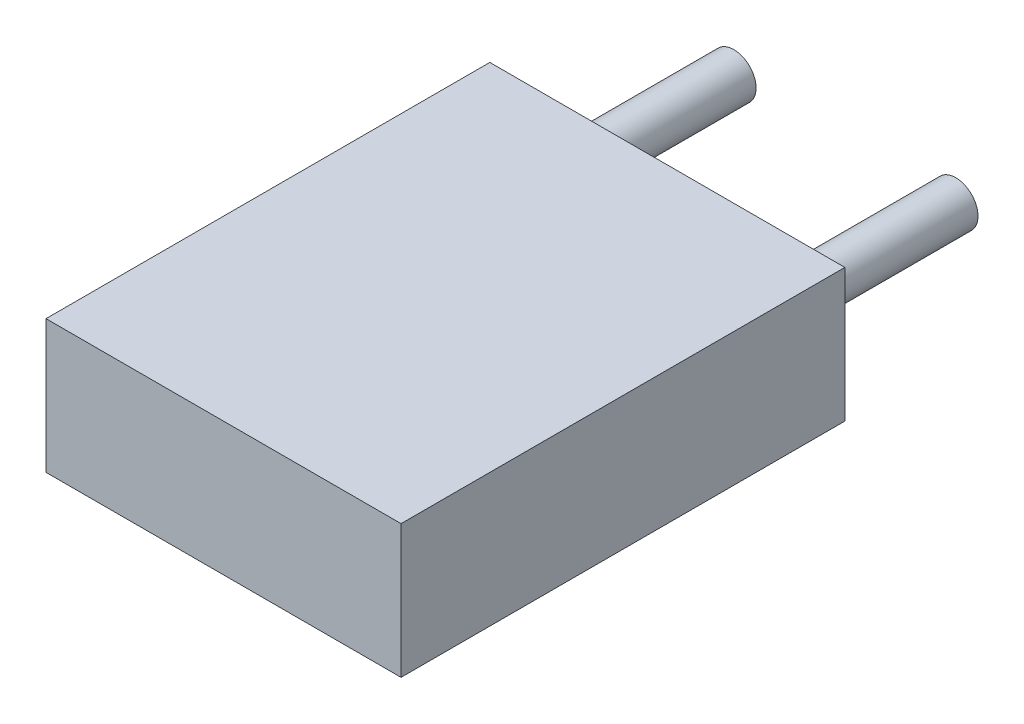
ISO-10303-21;
HEADER;
FILE_DESCRIPTION(('STEP AP214'),'2;1');
FILE_NAME('part.step','',(''),(''),'','','');
FILE_SCHEMA(('AUTOMOTIVE_DESIGN { 1 0 10303 214 1 1 1 1 }'));
ENDSEC;
DATA;
#1=APPLICATION_CONTEXT('core data for automotive mechanical design processes');
#2=APPLICATION_PROTOCOL_DEFINITION('international standard','automotive_design',2000,#1);
#3=PRODUCT_CONTEXT('',#1,'mechanical');
#4=PRODUCT('Part','Part','',(#3));
#5=PRODUCT_RELATED_PRODUCT_CATEGORY('part','',(#4));
#6=PRODUCT_DEFINITION_FORMATION('','',#4);
#7=PRODUCT_DEFINITION_CONTEXT('part definition',#1,'design');
#8=PRODUCT_DEFINITION('design','',#6,#7);
#9=PRODUCT_DEFINITION_SHAPE('','',#8);
#10=(LENGTH_UNIT() NAMED_UNIT(*) SI_UNIT(.MILLI.,.METRE.));
#11=(NAMED_UNIT(*) PLANE_ANGLE_UNIT() SI_UNIT($,.RADIAN.));
#12=(NAMED_UNIT(*) SI_UNIT($,.STERADIAN.) SOLID_ANGLE_UNIT());
#13=UNCERTAINTY_MEASURE_WITH_UNIT(LENGTH_MEASURE(1.E-05),#10,'distance_accuracy_value','');
#14=(GEOMETRIC_REPRESENTATION_CONTEXT(3) GLOBAL_UNCERTAINTY_ASSIGNED_CONTEXT((#13)) GLOBAL_UNIT_ASSIGNED_CONTEXT((#10,
#11,#12)) REPRESENTATION_CONTEXT('',''));
#15=CARTESIAN_POINT('',(0.,0.,0.));
#16=DIRECTION('',(0.,0.,1.));
#17=DIRECTION('',(1.,0.,0.));
#18=AXIS2_PLACEMENT_3D('',#15,#16,#17);
#19=CARTESIAN_POINT('',(2.5,0.,-2.));
#20=DIRECTION('',(0.,0.,1.));
#21=DIRECTION('',(1.,0.,0.));
#22=AXIS2_PLACEMENT_3D('',#19,#20,#21);
#23=CYLINDRICAL_SURFACE('',#22,0.25);
#24=CARTESIAN_POINT('',(2.5,0.,-2.));
#25=DIRECTION('',(0.,0.,1.));
#26=DIRECTION('',(1.,0.,0.));
#27=AXIS2_PLACEMENT_3D('',#24,#25,#26);
#28=CIRCLE('',#27,0.25);
#29=CARTESIAN_POINT('',(2.75,0.,-2.));
#30=VERTEX_POINT('',#29);
#31=EDGE_CURVE('E11',#30,#30,#28,.T.);
#32=ORIENTED_EDGE('',*,*,#31,.T.);
#33=EDGE_LOOP('',(#32));
#34=FACE_BOUND('',#33,.T.);
#35=CARTESIAN_POINT('',(2.5,0.,0.));
#36=DIRECTION('',(0.,0.,1.));
#37=DIRECTION('',(1.,0.,0.));
#38=AXIS2_PLACEMENT_3D('',#35,#36,#37);
#39=CIRCLE('',#38,0.25);
#40=CARTESIAN_POINT('',(2.75,0.,0.));
#41=VERTEX_POINT('',#40);
#42=EDGE_CURVE('E43',#41,#41,#39,.T.);
#43=ORIENTED_EDGE('',*,*,#42,.F.);
#44=EDGE_LOOP('',(#43));
#45=FACE_BOUND('',#44,.T.);
#46=ADVANCED_FACE('F40',(#34,#45),#23,.T.);
#47=CARTESIAN_POINT('',(2.5,0.,-2.));
#48=DIRECTION('',(0.,0.,1.));
#49=DIRECTION('',(1.,0.,0.));
#50=AXIS2_PLACEMENT_3D('',#47,#48,#49);
#51=PLANE('',#50);
#52=ORIENTED_EDGE('',*,*,#31,.F.);
#53=EDGE_LOOP('',(#52));
#54=FACE_BOUND('',#53,.T.);
#55=ADVANCED_FACE('F55',(#54),#51,.F.);
#56=CARTESIAN_POINT('',(2.5,0.,0.));
#57=DIRECTION('',(0.,0.,1.));
#58=DIRECTION('',(1.,0.,0.));
#59=AXIS2_PLACEMENT_3D('',#56,#57,#58);
#60=PLANE('',#59);
#61=ORIENTED_EDGE('',*,*,#42,.T.);
#62=EDGE_LOOP('',(#61));
#63=FACE_BOUND('',#62,.T.);
#64=ADVANCED_FACE('F52',(#63),#60,.T.);
#65=CLOSED_SHELL('',(#46,#55,#64));
#66=MANIFOLD_SOLID_BREP('B2',#65);
#67=CARTESIAN_POINT('',(0.,0.,-2.));
#68=DIRECTION('',(0.,0.,1.));
#69=DIRECTION('',(1.,0.,0.));
#70=AXIS2_PLACEMENT_3D('',#67,#68,#69);
#71=CYLINDRICAL_SURFACE('',#70,0.25);
#72=CARTESIAN_POINT('',(0.,0.,-2.));
#73=DIRECTION('',(0.,0.,1.));
#74=DIRECTION('',(1.,0.,0.));
#75=AXIS2_PLACEMENT_3D('',#72,#73,#74);
#76=CIRCLE('',#75,0.25);
#77=CARTESIAN_POINT('',(0.25,0.,-2.));
#78=VERTEX_POINT('',#77);
#79=EDGE_CURVE('E39',#78,#78,#76,.T.);
#80=ORIENTED_EDGE('',*,*,#79,.T.);
#81=EDGE_LOOP('',(#80));
#82=FACE_BOUND('',#81,.T.);
#83=CARTESIAN_POINT('',(0.,0.,0.));
#84=DIRECTION('',(0.,0.,1.));
#85=DIRECTION('',(1.,0.,0.));
#86=AXIS2_PLACEMENT_3D('',#83,#84,#85);
#87=CIRCLE('',#86,0.25);
#88=CARTESIAN_POINT('',(0.25,0.,0.));
#89=VERTEX_POINT('',#88);
#90=EDGE_CURVE('E93',#89,#89,#87,.T.);
#91=ORIENTED_EDGE('',*,*,#90,.F.);
#92=EDGE_LOOP('',(#91));
#93=FACE_BOUND('',#92,.T.);
#94=ADVANCED_FACE('F90',(#82,#93),#71,.T.);
#95=CARTESIAN_POINT('',(0.,0.,-2.));
#96=DIRECTION('',(0.,0.,1.));
#97=DIRECTION('',(1.,0.,0.));
#98=AXIS2_PLACEMENT_3D('',#95,#96,#97);
#99=PLANE('',#98);
#100=ORIENTED_EDGE('',*,*,#79,.F.);
#101=EDGE_LOOP('',(#100));
#102=FACE_BOUND('',#101,.T.);
#103=ADVANCED_FACE('F105',(#102),#99,.F.);
#104=CARTESIAN_POINT('',(0.,0.,0.));
#105=DIRECTION('',(0.,0.,1.));
#106=DIRECTION('',(1.,0.,0.));
#107=AXIS2_PLACEMENT_3D('',#104,#105,#106);
#108=PLANE('',#107);
#109=ORIENTED_EDGE('',*,*,#90,.T.);
#110=EDGE_LOOP('',(#109));
#111=FACE_BOUND('',#110,.T.);
#112=ADVANCED_FACE('F102',(#111),#108,.T.);
#113=CLOSED_SHELL('',(#94,#103,#112));
#114=MANIFOLD_SOLID_BREP('B6',#113);
#115=CARTESIAN_POINT('',(3.25,0.75,5.));
#116=DIRECTION('',(0.,-1.,0.));
#117=DIRECTION('',(0.,0.,-1.));
#118=AXIS2_PLACEMENT_3D('',#115,#116,#117);
#119=PLANE('',#118);
#120=DIRECTION('',(-1.,0.,0.));
#121=VECTOR('',#120,1.);
#122=CARTESIAN_POINT('',(3.25,0.75,0.));
#123=LINE('',#122,#121);
#124=CARTESIAN_POINT('',(3.25,0.75,0.));
#125=VERTEX_POINT('',#124);
#126=CARTESIAN_POINT('',(-0.75,0.75,0.));
#127=VERTEX_POINT('',#126);
#128=EDGE_CURVE('E194',#125,#127,#123,.T.);
#129=ORIENTED_EDGE('',*,*,#128,.T.);
#130=DIRECTION('',(0.,0.,-1.));
#131=VECTOR('',#130,1.);
#132=CARTESIAN_POINT('',(-0.75,0.75,5.));
#133=LINE('',#132,#131);
#134=CARTESIAN_POINT('',(-0.75,0.75,5.));
#135=VERTEX_POINT('',#134);
#136=EDGE_CURVE('E88',#135,#127,#133,.T.);
#137=ORIENTED_EDGE('',*,*,#136,.F.);
#138=DIRECTION('',(-1.,0.,0.));
#139=VECTOR('',#138,1.);
#140=CARTESIAN_POINT('',(3.25,0.75,5.));
#141=LINE('',#140,#139);
#142=CARTESIAN_POINT('',(3.25,0.75,5.));
#143=VERTEX_POINT('',#142);
#144=EDGE_CURVE('E182',#143,#135,#141,.T.);
#145=ORIENTED_EDGE('',*,*,#144,.F.);
#146=DIRECTION('',(0.,0.,-1.));
#147=VECTOR('',#146,1.);
#148=CARTESIAN_POINT('',(3.25,0.75,5.));
#149=LINE('',#148,#147);
#150=EDGE_CURVE('E190',#143,#125,#149,.T.);
#151=ORIENTED_EDGE('',*,*,#150,.T.);
#152=EDGE_LOOP('',(#129,#137,#145,#151));
#153=FACE_BOUND('',#152,.T.);
#154=ADVANCED_FACE('F131',(#153),#119,.F.);
#155=CARTESIAN_POINT('',(-0.75,0.75,5.));
#156=DIRECTION('',(1.,0.,0.));
#157=DIRECTION('',(0.,0.,-1.));
#158=AXIS2_PLACEMENT_3D('',#155,#156,#157);
#159=PLANE('',#158);
#160=DIRECTION('',(0.,-1.,0.));
#161=VECTOR('',#160,1.);
#162=CARTESIAN_POINT('',(-0.75,0.75,0.));
#163=LINE('',#162,#161);
#164=CARTESIAN_POINT('',(-0.75,-0.75,0.));
#165=VERTEX_POINT('',#164);
#166=EDGE_CURVE('E186',#127,#165,#163,.T.);
#167=ORIENTED_EDGE('',*,*,#166,.T.);
#168=DIRECTION('',(0.,0.,-1.));
#169=VECTOR('',#168,1.);
#170=CARTESIAN_POINT('',(-0.75,-0.75,5.));
#171=LINE('',#170,#169);
#172=CARTESIAN_POINT('',(-0.75,-0.75,5.));
#173=VERTEX_POINT('',#172);
#174=EDGE_CURVE('E139',#173,#165,#171,.T.);
#175=ORIENTED_EDGE('',*,*,#174,.F.);
#176=DIRECTION('',(0.,-1.,0.));
#177=VECTOR('',#176,1.);
#178=CARTESIAN_POINT('',(-0.75,0.75,5.));
#179=LINE('',#178,#177);
#180=EDGE_CURVE('E177',#135,#173,#179,.T.);
#181=ORIENTED_EDGE('',*,*,#180,.F.);
#182=ORIENTED_EDGE('',*,*,#136,.T.);
#183=EDGE_LOOP('',(#167,#175,#181,#182));
#184=FACE_BOUND('',#183,.T.);
#185=ADVANCED_FACE('F185',(#184),#159,.F.);
#186=CARTESIAN_POINT('',(-0.75,-0.75,5.));
#187=DIRECTION('',(0.,1.,0.));
#188=DIRECTION('',(0.,0.,1.));
#189=AXIS2_PLACEMENT_3D('',#186,#187,#188);
#190=PLANE('',#189);
#191=DIRECTION('',(1.,0.,0.));
#192=VECTOR('',#191,1.);
#193=CARTESIAN_POINT('',(-0.75,-0.75,0.));
#194=LINE('',#193,#192);
#195=CARTESIAN_POINT('',(3.25,-0.75,0.));
#196=VERTEX_POINT('',#195);
#197=EDGE_CURVE('E164',#165,#196,#194,.T.);
#198=ORIENTED_EDGE('',*,*,#197,.T.);
#199=DIRECTION('',(0.,0.,-1.));
#200=VECTOR('',#199,1.);
#201=CARTESIAN_POINT('',(3.25,-0.75,5.));
#202=LINE('',#201,#200);
#203=CARTESIAN_POINT('',(3.25,-0.75,5.));
#204=VERTEX_POINT('',#203);
#205=EDGE_CURVE('E187',#204,#196,#202,.T.);
#206=ORIENTED_EDGE('',*,*,#205,.F.);
#207=DIRECTION('',(1.,0.,0.));
#208=VECTOR('',#207,1.);
#209=CARTESIAN_POINT('',(-0.75,-0.75,5.));
#210=LINE('',#209,#208);
#211=EDGE_CURVE('E180',#173,#204,#210,.T.);
#212=ORIENTED_EDGE('',*,*,#211,.F.);
#213=ORIENTED_EDGE('',*,*,#174,.T.);
#214=EDGE_LOOP('',(#198,#206,#212,#213));
#215=FACE_BOUND('',#214,.T.);
#216=ADVANCED_FACE('F188',(#215),#190,.F.);
#217=CARTESIAN_POINT('',(3.25,-0.75,5.));
#218=DIRECTION('',(-1.,0.,0.));
#219=DIRECTION('',(0.,0.,1.));
#220=AXIS2_PLACEMENT_3D('',#217,#218,#219);
#221=PLANE('',#220);
#222=DIRECTION('',(0.,1.,0.));
#223=VECTOR('',#222,1.);
#224=CARTESIAN_POINT('',(3.25,-0.75,0.));
#225=LINE('',#224,#223);
#226=EDGE_CURVE('E170',#196,#125,#225,.T.);
#227=ORIENTED_EDGE('',*,*,#226,.T.);
#228=ORIENTED_EDGE('',*,*,#150,.F.);
#229=DIRECTION('',(0.,1.,0.));
#230=VECTOR('',#229,1.);
#231=CARTESIAN_POINT('',(3.25,-0.75,5.));
#232=LINE('',#231,#230);
#233=EDGE_CURVE('E147',#204,#143,#232,.T.);
#234=ORIENTED_EDGE('',*,*,#233,.F.);
#235=ORIENTED_EDGE('',*,*,#205,.T.);
#236=EDGE_LOOP('',(#227,#228,#234,#235));
#237=FACE_BOUND('',#236,.T.);
#238=ADVANCED_FACE('F201',(#237),#221,.F.);
#239=CARTESIAN_POINT('',(0.,0.,5.));
#240=DIRECTION('',(0.,0.,1.));
#241=DIRECTION('',(1.,0.,0.));
#242=AXIS2_PLACEMENT_3D('',#239,#240,#241);
#243=PLANE('',#242);
#244=ORIENTED_EDGE('',*,*,#144,.T.);
#245=ORIENTED_EDGE('',*,*,#180,.T.);
#246=ORIENTED_EDGE('',*,*,#211,.T.);
#247=ORIENTED_EDGE('',*,*,#233,.T.);
#248=EDGE_LOOP('',(#244,#245,#246,#247));
#249=FACE_BOUND('',#248,.T.);
#250=ADVANCED_FACE('F178',(#249),#243,.T.);
#251=CARTESIAN_POINT('',(0.,0.,0.));
#252=DIRECTION('',(0.,0.,1.));
#253=DIRECTION('',(1.,0.,0.));
#254=AXIS2_PLACEMENT_3D('',#251,#252,#253);
#255=PLANE('',#254);
#256=ORIENTED_EDGE('',*,*,#128,.F.);
#257=ORIENTED_EDGE('',*,*,#226,.F.);
#258=ORIENTED_EDGE('',*,*,#197,.F.);
#259=ORIENTED_EDGE('',*,*,#166,.F.);
#260=EDGE_LOOP('',(#256,#257,#258,#259));
#261=FACE_BOUND('',#260,.T.);
#262=ADVANCED_FACE('F204',(#261),#255,.F.);
#263=CLOSED_SHELL('',(#154,#185,#216,#238,#250,#262));
#264=MANIFOLD_SOLID_BREP('B34',#263);
#265=ADVANCED_BREP_SHAPE_REPRESENTATION('',(#18,#66,#114,#264),#14);
#266=SHAPE_DEFINITION_REPRESENTATION(#9,#265);
ENDSEC;
END-ISO-10303-21;
